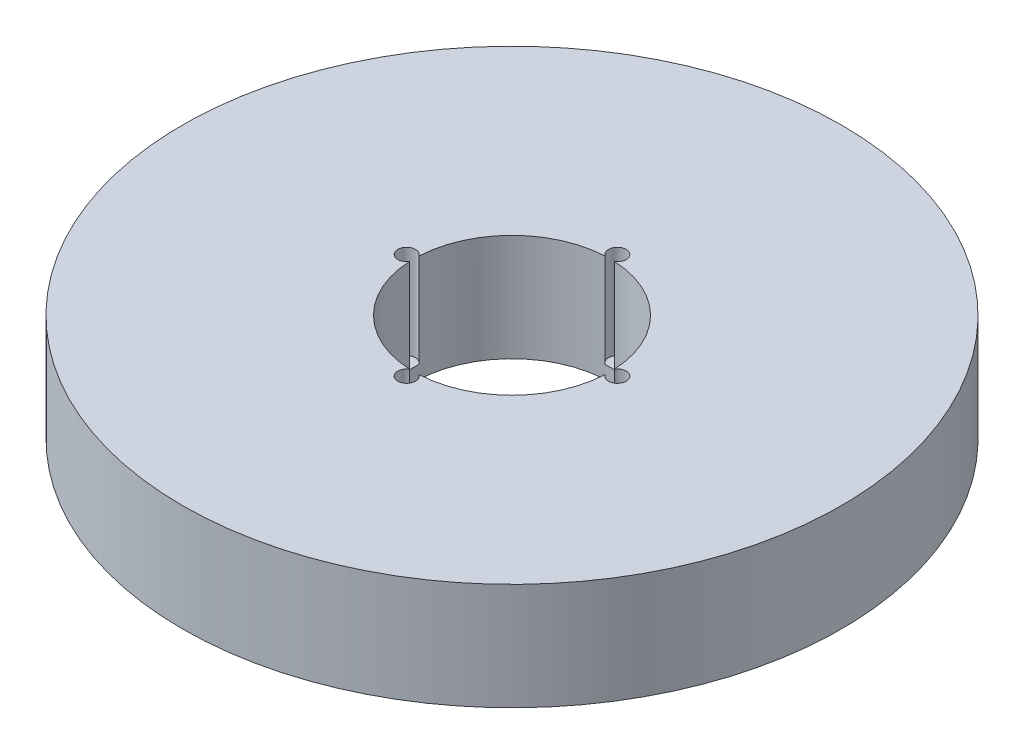
ISO-10303-21;
HEADER;
FILE_DESCRIPTION(('STEP AP214'),'2;1');
FILE_NAME('part.step','',(''),(''),'','','');
FILE_SCHEMA(('AUTOMOTIVE_DESIGN { 1 0 10303 214 1 1 1 1 }'));
ENDSEC;
DATA;
#1=APPLICATION_CONTEXT('core data for automotive mechanical design processes');
#2=APPLICATION_PROTOCOL_DEFINITION('international standard','automotive_design',2000,#1);
#3=PRODUCT_CONTEXT('',#1,'mechanical');
#4=PRODUCT('Part','Part','',(#3));
#5=PRODUCT_RELATED_PRODUCT_CATEGORY('part','',(#4));
#6=PRODUCT_DEFINITION_FORMATION('','',#4);
#7=PRODUCT_DEFINITION_CONTEXT('part definition',#1,'design');
#8=PRODUCT_DEFINITION('design','',#6,#7);
#9=PRODUCT_DEFINITION_SHAPE('','',#8);
#10=(LENGTH_UNIT() NAMED_UNIT(*) SI_UNIT(.MILLI.,.METRE.));
#11=(NAMED_UNIT(*) PLANE_ANGLE_UNIT() SI_UNIT($,.RADIAN.));
#12=(NAMED_UNIT(*) SI_UNIT($,.STERADIAN.) SOLID_ANGLE_UNIT());
#13=UNCERTAINTY_MEASURE_WITH_UNIT(LENGTH_MEASURE(1.E-05),#10,'distance_accuracy_value','');
#14=(GEOMETRIC_REPRESENTATION_CONTEXT(3) GLOBAL_UNCERTAINTY_ASSIGNED_CONTEXT((#13)) GLOBAL_UNIT_ASSIGNED_CONTEXT((#10,
#11,#12)) REPRESENTATION_CONTEXT('',''));
#15=CARTESIAN_POINT('',(0.,0.,0.));
#16=DIRECTION('',(0.,0.,1.));
#17=DIRECTION('',(1.,0.,0.));
#18=AXIS2_PLACEMENT_3D('',#15,#16,#17);
#19=CARTESIAN_POINT('',(0.,30.,0.));
#20=DIRECTION('',(0.,-1.,0.));
#21=DIRECTION('',(0.,0.,-1.));
#22=AXIS2_PLACEMENT_3D('',#19,#20,#21);
#23=CYLINDRICAL_SURFACE('',#22,92.5);
#24=CARTESIAN_POINT('',(0.,30.,0.));
#25=DIRECTION('',(0.,1.,0.));
#26=DIRECTION('',(0.,0.,1.));
#27=AXIS2_PLACEMENT_3D('',#24,#25,#26);
#28=CIRCLE('',#27,92.5);
#29=CARTESIAN_POINT('',(0.,30.,92.5));
#30=VERTEX_POINT('',#29);
#31=EDGE_CURVE('E145',#30,#30,#28,.T.);
#32=ORIENTED_EDGE('',*,*,#31,.F.);
#33=EDGE_LOOP('',(#32));
#34=FACE_BOUND('',#33,.T.);
#35=CARTESIAN_POINT('',(0.,0.,0.));
#36=DIRECTION('',(0.,1.,0.));
#37=DIRECTION('',(0.,0.,1.));
#38=AXIS2_PLACEMENT_3D('',#35,#36,#37);
#39=CIRCLE('',#38,92.5);
#40=CARTESIAN_POINT('',(0.,0.,92.5));
#41=VERTEX_POINT('',#40);
#42=EDGE_CURVE('E143',#41,#41,#39,.T.);
#43=ORIENTED_EDGE('',*,*,#42,.T.);
#44=EDGE_LOOP('',(#43));
#45=FACE_BOUND('',#44,.T.);
#46=ADVANCED_FACE('F39',(#34,#45),#23,.T.);
#47=CARTESIAN_POINT('',(0.,30.,0.));
#48=DIRECTION('',(0.,1.,0.));
#49=DIRECTION('',(0.,0.,1.));
#50=AXIS2_PLACEMENT_3D('',#47,#48,#49);
#51=PLANE('',#50);
#52=CARTESIAN_POINT('',(1.03249944352089E-13,30.,29.5719593868141));
#53=DIRECTION('',(0.,1.,0.));
#54=DIRECTION('',(1.,0.,0.));
#55=AXIS2_PLACEMENT_3D('',#52,#53,#54);
#56=CIRCLE('',#55,2.47776264958099);
#57=CARTESIAN_POINT('',(-1.30994545469824,30.,27.4687830619726));
#58=VERTEX_POINT('',#57);
#59=CARTESIAN_POINT('',(1.30994545469843,30.,27.4687830619726));
#60=VERTEX_POINT('',#59);
#61=EDGE_CURVE('E152',#58,#60,#56,.T.);
#62=ORIENTED_EDGE('',*,*,#61,.F.);
#63=CARTESIAN_POINT('',(0.,30.,0.));
#64=DIRECTION('',(0.,1.,0.));
#65=DIRECTION('',(0.,0.,1.));
#66=AXIS2_PLACEMENT_3D('',#63,#64,#65);
#67=CIRCLE('',#66,27.5);
#68=CARTESIAN_POINT('',(-27.4687830619726,30.,1.30994545469833));
#69=VERTEX_POINT('',#68);
#70=EDGE_CURVE('E133',#69,#58,#67,.T.);
#71=ORIENTED_EDGE('',*,*,#70,.F.);
#72=CARTESIAN_POINT('',(-29.5719593868141,30.,0.));
#73=DIRECTION('',(0.,1.,0.));
#74=DIRECTION('',(0.,0.,1.));
#75=AXIS2_PLACEMENT_3D('',#72,#73,#74);
#76=CIRCLE('',#75,2.47776264958099);
#77=CARTESIAN_POINT('',(-27.4687830619726,30.,-1.30994545469833));
#78=VERTEX_POINT('',#77);
#79=EDGE_CURVE('E128',#78,#69,#76,.T.);
#80=ORIENTED_EDGE('',*,*,#79,.F.);
#81=CARTESIAN_POINT('',(-1.30994545469862,30.,-27.4687830619726));
#82=VERTEX_POINT('',#81);
#83=EDGE_CURVE('E121',#82,#78,#67,.T.);
#84=ORIENTED_EDGE('',*,*,#83,.F.);
#85=CARTESIAN_POINT('',(-3.09749833056266E-13,30.,-29.5719593868141));
#86=DIRECTION('',(0.,1.,0.));
#87=DIRECTION('',(-1.,0.,0.));
#88=AXIS2_PLACEMENT_3D('',#85,#86,#87);
#89=CIRCLE('',#88,2.47776264958099);
#90=CARTESIAN_POINT('',(1.30994545469805,30.,-27.4687830619727));
#91=VERTEX_POINT('',#90);
#92=EDGE_CURVE('E105',#91,#82,#89,.T.);
#93=ORIENTED_EDGE('',*,*,#92,.F.);
#94=CARTESIAN_POINT('',(27.4687830619726,30.,-1.30994545469833));
#95=VERTEX_POINT('',#94);
#96=EDGE_CURVE('E131',#95,#91,#67,.T.);
#97=ORIENTED_EDGE('',*,*,#96,.F.);
#98=CARTESIAN_POINT('',(29.5719593868141,30.,0.));
#99=DIRECTION('',(0.,1.,0.));
#100=DIRECTION('',(0.,0.,-1.));
#101=AXIS2_PLACEMENT_3D('',#98,#99,#100);
#102=CIRCLE('',#101,2.47776264958099);
#103=CARTESIAN_POINT('',(27.4687830619726,30.,1.30994545469833));
#104=VERTEX_POINT('',#103);
#105=EDGE_CURVE('E154',#104,#95,#102,.T.);
#106=ORIENTED_EDGE('',*,*,#105,.F.);
#107=EDGE_CURVE('E134',#60,#104,#67,.T.);
#108=ORIENTED_EDGE('',*,*,#107,.F.);
#109=EDGE_LOOP('',(#62,#71,#80,#84,#93,#97,#106,#108));
#110=FACE_BOUND('',#109,.T.);
#111=ORIENTED_EDGE('',*,*,#31,.T.);
#112=EDGE_LOOP('',(#111));
#113=FACE_BOUND('',#112,.T.);
#114=ADVANCED_FACE('F130',(#110,#113),#51,.T.);
#115=CARTESIAN_POINT('',(0.,0.,0.));
#116=DIRECTION('',(0.,1.,0.));
#117=DIRECTION('',(0.,0.,1.));
#118=AXIS2_PLACEMENT_3D('',#115,#116,#117);
#119=PLANE('',#118);
#120=CARTESIAN_POINT('',(0.,0.,0.));
#121=DIRECTION('',(0.,1.,0.));
#122=DIRECTION('',(0.,0.,1.));
#123=AXIS2_PLACEMENT_3D('',#120,#121,#122);
#124=CIRCLE('',#123,27.5);
#125=CARTESIAN_POINT('',(0.,0.,27.5));
#126=VERTEX_POINT('',#125);
#127=EDGE_CURVE('E135',#126,#126,#124,.T.);
#128=ORIENTED_EDGE('',*,*,#127,.T.);
#129=EDGE_LOOP('',(#128));
#130=FACE_BOUND('',#129,.T.);
#131=ORIENTED_EDGE('',*,*,#42,.F.);
#132=EDGE_LOOP('',(#131));
#133=FACE_BOUND('',#132,.T.);
#134=ADVANCED_FACE('F195',(#130,#133),#119,.F.);
#135=CARTESIAN_POINT('',(0.,30.,0.));
#136=DIRECTION('',(0.,-1.,0.));
#137=DIRECTION('',(0.,0.,-1.));
#138=AXIS2_PLACEMENT_3D('',#135,#136,#137);
#139=CYLINDRICAL_SURFACE('',#138,27.5);
#140=DIRECTION('',(0.,1.,0.));
#141=VECTOR('',#140,1.);
#142=CARTESIAN_POINT('',(-1.3099454546982,16.8196303305307,27.4687830619726));
#143=LINE('',#142,#141);
#144=CARTESIAN_POINT('',(-1.30994545469824,3.63926066106146,27.4687830619726));
#145=VERTEX_POINT('',#144);
#146=EDGE_CURVE('E11',#145,#58,#143,.T.);
#147=ORIENTED_EDGE('',*,*,#146,.F.);
#148=CARTESIAN_POINT('',(0.,3.63926066106146,0.));
#149=DIRECTION('',(0.,1.,0.));
#150=DIRECTION('',(0.,0.,1.));
#151=AXIS2_PLACEMENT_3D('',#148,#149,#150);
#152=CIRCLE('',#151,27.5);
#153=CARTESIAN_POINT('',(1.30994545469843,3.63926066106146,27.4687830619726));
#154=VERTEX_POINT('',#153);
#155=EDGE_CURVE('E169',#145,#154,#152,.T.);
#156=ORIENTED_EDGE('',*,*,#155,.T.);
#157=DIRECTION('',(0.,1.,0.));
#158=VECTOR('',#157,1.);
#159=CARTESIAN_POINT('',(1.3099454546984,16.8196303305307,27.4687830619726));
#160=LINE('',#159,#158);
#161=EDGE_CURVE('E46',#60,#154,#160,.F.);
#162=ORIENTED_EDGE('',*,*,#161,.F.);
#163=ORIENTED_EDGE('',*,*,#107,.T.);
#164=DIRECTION('',(0.,1.,0.));
#165=VECTOR('',#164,1.);
#166=CARTESIAN_POINT('',(27.4687830619726,16.8196303305307,1.3099454546983));
#167=LINE('',#166,#165);
#168=CARTESIAN_POINT('',(27.4687830619726,3.63926066106146,1.30994545469833));
#169=VERTEX_POINT('',#168);
#170=EDGE_CURVE('E151',#169,#104,#167,.T.);
#171=ORIENTED_EDGE('',*,*,#170,.F.);
#172=CARTESIAN_POINT('',(0.,3.63926066106146,0.));
#173=DIRECTION('',(0.,1.,0.));
#174=DIRECTION('',(0.,0.,1.));
#175=AXIS2_PLACEMENT_3D('',#172,#173,#174);
#176=CIRCLE('',#175,27.5);
#177=CARTESIAN_POINT('',(27.4687830619726,3.63926066106146,-1.30994545469833));
#178=VERTEX_POINT('',#177);
#179=EDGE_CURVE('E173',#169,#178,#176,.T.);
#180=ORIENTED_EDGE('',*,*,#179,.T.);
#181=DIRECTION('',(0.,1.,0.));
#182=VECTOR('',#181,1.);
#183=CARTESIAN_POINT('',(27.4687830619726,16.8196303305307,-1.3099454546983));
#184=LINE('',#183,#182);
#185=EDGE_CURVE('E168',#95,#178,#184,.F.);
#186=ORIENTED_EDGE('',*,*,#185,.F.);
#187=ORIENTED_EDGE('',*,*,#96,.T.);
#188=DIRECTION('',(0.,1.,0.));
#189=VECTOR('',#188,1.);
#190=CARTESIAN_POINT('',(1.30994545469801,16.8196303305307,-27.4687830619726));
#191=LINE('',#190,#189);
#192=CARTESIAN_POINT('',(1.30994545469805,3.63926066106146,-27.4687830619727));
#193=VERTEX_POINT('',#192);
#194=EDGE_CURVE('E108',#193,#91,#191,.T.);
#195=ORIENTED_EDGE('',*,*,#194,.F.);
#196=CARTESIAN_POINT('',(0.,3.63926066106146,0.));
#197=DIRECTION('',(0.,1.,0.));
#198=DIRECTION('',(0.,0.,1.));
#199=AXIS2_PLACEMENT_3D('',#196,#197,#198);
#200=CIRCLE('',#199,27.5);
#201=CARTESIAN_POINT('',(-1.30994545469862,3.63926066106146,-27.4687830619726));
#202=VERTEX_POINT('',#201);
#203=EDGE_CURVE('E122',#193,#202,#200,.T.);
#204=ORIENTED_EDGE('',*,*,#203,.T.);
#205=DIRECTION('',(0.,1.,0.));
#206=VECTOR('',#205,1.);
#207=CARTESIAN_POINT('',(-1.30994545469859,16.8196303305307,-27.4687830619726));
#208=LINE('',#207,#206);
#209=EDGE_CURVE('E106',#82,#202,#208,.F.);
#210=ORIENTED_EDGE('',*,*,#209,.F.);
#211=ORIENTED_EDGE('',*,*,#83,.T.);
#212=DIRECTION('',(0.,1.,0.));
#213=VECTOR('',#212,1.);
#214=CARTESIAN_POINT('',(-27.4687830619726,16.8196303305307,-1.3099454546983));
#215=LINE('',#214,#213);
#216=CARTESIAN_POINT('',(-27.4687830619726,3.63926066106146,-1.30994545469833));
#217=VERTEX_POINT('',#216);
#218=EDGE_CURVE('E177',#217,#78,#215,.T.);
#219=ORIENTED_EDGE('',*,*,#218,.F.);
#220=CARTESIAN_POINT('',(0.,3.63926066106146,0.));
#221=DIRECTION('',(0.,1.,0.));
#222=DIRECTION('',(0.,0.,1.));
#223=AXIS2_PLACEMENT_3D('',#220,#221,#222);
#224=CIRCLE('',#223,27.5);
#225=CARTESIAN_POINT('',(-27.4687830619726,3.63926066106146,1.30994545469833));
#226=VERTEX_POINT('',#225);
#227=EDGE_CURVE('E185',#217,#226,#224,.T.);
#228=ORIENTED_EDGE('',*,*,#227,.T.);
#229=DIRECTION('',(0.,1.,0.));
#230=VECTOR('',#229,1.);
#231=CARTESIAN_POINT('',(-27.4687830619726,16.8196303305307,1.3099454546983));
#232=LINE('',#231,#230);
#233=EDGE_CURVE('E179',#69,#226,#232,.F.);
#234=ORIENTED_EDGE('',*,*,#233,.F.);
#235=ORIENTED_EDGE('',*,*,#70,.T.);
#236=EDGE_LOOP('',(#147,#156,#162,#163,#171,#180,#186,#187,#195,#204,#210,#211,#219,#228,#234,#235));
#237=FACE_BOUND('',#236,.T.);
#238=ORIENTED_EDGE('',*,*,#127,.F.);
#239=EDGE_LOOP('',(#238));
#240=FACE_BOUND('',#239,.T.);
#241=ADVANCED_FACE('F117',(#237,#240),#139,.F.);
#242=CARTESIAN_POINT('',(-29.5719593868141,3.63926066106146,0.));
#243=DIRECTION('',(0.,1.,0.));
#244=DIRECTION('',(0.,0.,1.));
#245=AXIS2_PLACEMENT_3D('',#242,#243,#244);
#246=CYLINDRICAL_SURFACE('',#245,2.47776264958099);
#247=ORIENTED_EDGE('',*,*,#218,.T.);
#248=ORIENTED_EDGE('',*,*,#79,.T.);
#249=ORIENTED_EDGE('',*,*,#233,.T.);
#250=CARTESIAN_POINT('',(-29.5719593868141,3.63926066106146,0.));
#251=DIRECTION('',(0.,1.,0.));
#252=DIRECTION('',(0.,0.,1.));
#253=AXIS2_PLACEMENT_3D('',#250,#251,#252);
#254=CIRCLE('',#253,2.47776264958099);
#255=EDGE_CURVE('E140',#217,#226,#254,.T.);
#256=ORIENTED_EDGE('',*,*,#255,.F.);
#257=EDGE_LOOP('',(#247,#248,#249,#256));
#258=FACE_BOUND('',#257,.T.);
#259=ADVANCED_FACE('F200',(#258),#246,.F.);
#260=CARTESIAN_POINT('',(-29.5719593868141,3.63926066106146,0.));
#261=DIRECTION('',(0.,1.,0.));
#262=DIRECTION('',(0.,0.,1.));
#263=AXIS2_PLACEMENT_3D('',#260,#261,#262);
#264=PLANE('',#263);
#265=ORIENTED_EDGE('',*,*,#255,.T.);
#266=ORIENTED_EDGE('',*,*,#227,.F.);
#267=EDGE_LOOP('',(#265,#266));
#268=FACE_BOUND('',#267,.T.);
#269=ADVANCED_FACE('F202',(#268),#264,.T.);
#270=CARTESIAN_POINT('',(-3.09749833056266E-13,3.63926066106146,-29.5719593868141));
#271=DIRECTION('',(0.,1.,0.));
#272=DIRECTION('',(0.,0.,1.));
#273=AXIS2_PLACEMENT_3D('',#270,#271,#272);
#274=CYLINDRICAL_SURFACE('',#273,2.47776264958099);
#275=ORIENTED_EDGE('',*,*,#194,.T.);
#276=ORIENTED_EDGE('',*,*,#92,.T.);
#277=ORIENTED_EDGE('',*,*,#209,.T.);
#278=CARTESIAN_POINT('',(-3.09749833056266E-13,3.63926066106146,-29.5719593868141));
#279=DIRECTION('',(0.,1.,0.));
#280=DIRECTION('',(-1.,0.,0.));
#281=AXIS2_PLACEMENT_3D('',#278,#279,#280);
#282=CIRCLE('',#281,2.47776264958099);
#283=EDGE_CURVE('E111',#193,#202,#282,.T.);
#284=ORIENTED_EDGE('',*,*,#283,.F.);
#285=EDGE_LOOP('',(#275,#276,#277,#284));
#286=FACE_BOUND('',#285,.T.);
#287=ADVANCED_FACE('F102',(#286),#274,.F.);
#288=CARTESIAN_POINT('',(-3.09749833056266E-13,3.63926066106146,-29.5719593868141));
#289=DIRECTION('',(0.,1.,0.));
#290=DIRECTION('',(-1.,0.,0.));
#291=AXIS2_PLACEMENT_3D('',#288,#289,#290);
#292=PLANE('',#291);
#293=ORIENTED_EDGE('',*,*,#283,.T.);
#294=ORIENTED_EDGE('',*,*,#203,.F.);
#295=EDGE_LOOP('',(#293,#294));
#296=FACE_BOUND('',#295,.T.);
#297=ADVANCED_FACE('F211',(#296),#292,.T.);
#298=CARTESIAN_POINT('',(29.5719593868141,3.63926066106146,0.));
#299=DIRECTION('',(0.,1.,0.));
#300=DIRECTION('',(0.,0.,1.));
#301=AXIS2_PLACEMENT_3D('',#298,#299,#300);
#302=CYLINDRICAL_SURFACE('',#301,2.47776264958099);
#303=ORIENTED_EDGE('',*,*,#170,.T.);
#304=ORIENTED_EDGE('',*,*,#105,.T.);
#305=ORIENTED_EDGE('',*,*,#185,.T.);
#306=CARTESIAN_POINT('',(29.5719593868141,3.63926066106146,0.));
#307=DIRECTION('',(0.,1.,0.));
#308=DIRECTION('',(0.,0.,-1.));
#309=AXIS2_PLACEMENT_3D('',#306,#307,#308);
#310=CIRCLE('',#309,2.47776264958099);
#311=EDGE_CURVE('E56',#169,#178,#310,.T.);
#312=ORIENTED_EDGE('',*,*,#311,.F.);
#313=EDGE_LOOP('',(#303,#304,#305,#312));
#314=FACE_BOUND('',#313,.T.);
#315=ADVANCED_FACE('F212',(#314),#302,.F.);
#316=CARTESIAN_POINT('',(29.5719593868141,3.63926066106146,0.));
#317=DIRECTION('',(0.,1.,0.));
#318=DIRECTION('',(0.,0.,-1.));
#319=AXIS2_PLACEMENT_3D('',#316,#317,#318);
#320=PLANE('',#319);
#321=ORIENTED_EDGE('',*,*,#311,.T.);
#322=ORIENTED_EDGE('',*,*,#179,.F.);
#323=EDGE_LOOP('',(#321,#322));
#324=FACE_BOUND('',#323,.T.);
#325=ADVANCED_FACE('F217',(#324),#320,.T.);
#326=CARTESIAN_POINT('',(1.03249944352089E-13,3.63926066106146,29.5719593868141));
#327=DIRECTION('',(0.,1.,0.));
#328=DIRECTION('',(0.,0.,1.));
#329=AXIS2_PLACEMENT_3D('',#326,#327,#328);
#330=CYLINDRICAL_SURFACE('',#329,2.47776264958099);
#331=ORIENTED_EDGE('',*,*,#146,.T.);
#332=ORIENTED_EDGE('',*,*,#61,.T.);
#333=ORIENTED_EDGE('',*,*,#161,.T.);
#334=CARTESIAN_POINT('',(1.03249944352089E-13,3.63926066106146,29.5719593868141));
#335=DIRECTION('',(0.,1.,0.));
#336=DIRECTION('',(1.,0.,0.));
#337=AXIS2_PLACEMENT_3D('',#334,#335,#336);
#338=CIRCLE('',#337,2.47776264958099);
#339=EDGE_CURVE('E55',#145,#154,#338,.T.);
#340=ORIENTED_EDGE('',*,*,#339,.F.);
#341=EDGE_LOOP('',(#331,#332,#333,#340));
#342=FACE_BOUND('',#341,.T.);
#343=ADVANCED_FACE('F170',(#342),#330,.F.);
#344=CARTESIAN_POINT('',(1.03249944352089E-13,3.63926066106146,29.5719593868141));
#345=DIRECTION('',(0.,1.,0.));
#346=DIRECTION('',(1.,0.,0.));
#347=AXIS2_PLACEMENT_3D('',#344,#345,#346);
#348=PLANE('',#347);
#349=ORIENTED_EDGE('',*,*,#339,.T.);
#350=ORIENTED_EDGE('',*,*,#155,.F.);
#351=EDGE_LOOP('',(#349,#350));
#352=FACE_BOUND('',#351,.T.);
#353=ADVANCED_FACE('F224',(#352),#348,.T.);
#354=CLOSED_SHELL('',(#46,#114,#134,#241,#259,#269,#287,#297,#315,#325,#343,#353));
#355=MANIFOLD_SOLID_BREP('B2',#354);
#356=ADVANCED_BREP_SHAPE_REPRESENTATION('',(#18,#355),#14);
#357=SHAPE_DEFINITION_REPRESENTATION(#9,#356);
ENDSEC;
END-ISO-10303-21;
